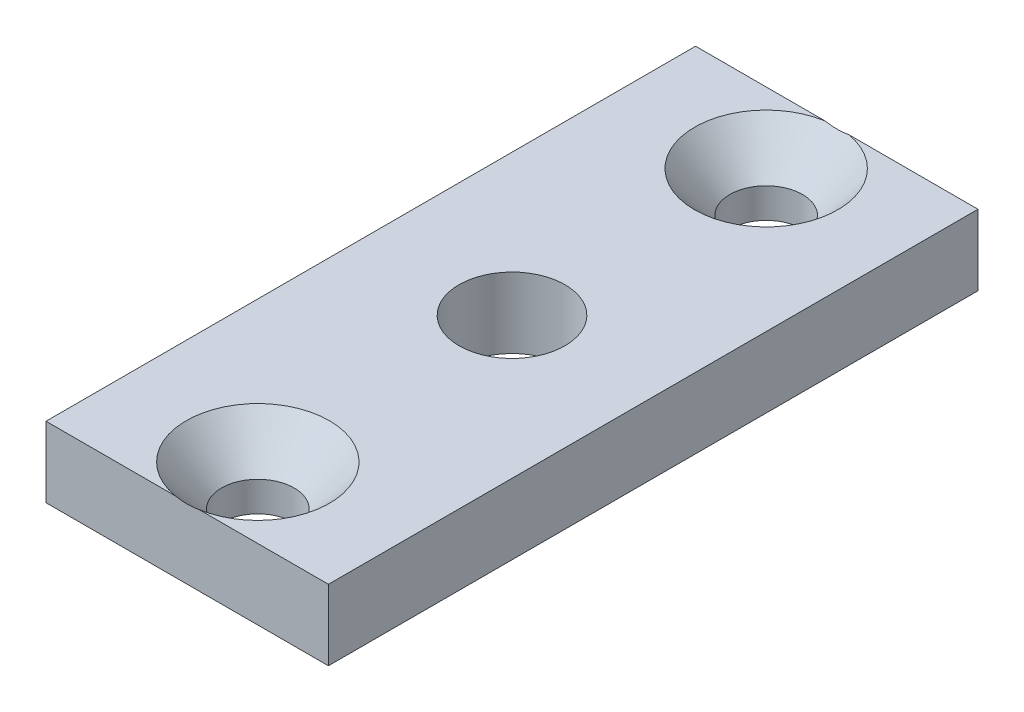
ISO-10303-21;
HEADER;
FILE_DESCRIPTION(('STEP AP214'),'2;1');
FILE_NAME('part.step','',(''),(''),'','','');
FILE_SCHEMA(('AUTOMOTIVE_DESIGN { 1 0 10303 214 1 1 1 1 }'));
ENDSEC;
DATA;
#1=APPLICATION_CONTEXT('core data for automotive mechanical design processes');
#2=APPLICATION_PROTOCOL_DEFINITION('international standard','automotive_design',2000,#1);
#3=PRODUCT_CONTEXT('',#1,'mechanical');
#4=PRODUCT('Part','Part','',(#3));
#5=PRODUCT_RELATED_PRODUCT_CATEGORY('part','',(#4));
#6=PRODUCT_DEFINITION_FORMATION('','',#4);
#7=PRODUCT_DEFINITION_CONTEXT('part definition',#1,'design');
#8=PRODUCT_DEFINITION('design','',#6,#7);
#9=PRODUCT_DEFINITION_SHAPE('','',#8);
#10=(LENGTH_UNIT() NAMED_UNIT(*) SI_UNIT(.MILLI.,.METRE.));
#11=(NAMED_UNIT(*) PLANE_ANGLE_UNIT() SI_UNIT($,.RADIAN.));
#12=(NAMED_UNIT(*) SI_UNIT($,.STERADIAN.) SOLID_ANGLE_UNIT());
#13=UNCERTAINTY_MEASURE_WITH_UNIT(LENGTH_MEASURE(1.E-05),#10,'distance_accuracy_value','');
#14=(GEOMETRIC_REPRESENTATION_CONTEXT(3) GLOBAL_UNCERTAINTY_ASSIGNED_CONTEXT((#13)) GLOBAL_UNIT_ASSIGNED_CONTEXT((#10,
#11,#12)) REPRESENTATION_CONTEXT('',''));
#15=CARTESIAN_POINT('',(0.,0.,0.));
#16=DIRECTION('',(0.,0.,1.));
#17=DIRECTION('',(1.,0.,0.));
#18=AXIS2_PLACEMENT_3D('',#15,#16,#17);
#19=CARTESIAN_POINT('',(-12.7,3.175,58.42));
#20=DIRECTION('',(0.,-1.,0.));
#21=DIRECTION('',(0.,0.,-1.));
#22=AXIS2_PLACEMENT_3D('',#19,#20,#21);
#23=PLANE('',#22);
#24=CARTESIAN_POINT('',(0.,3.175,29.21));
#25=DIRECTION('',(0.,1.,0.));
#26=DIRECTION('',(0.,0.,1.));
#27=AXIS2_PLACEMENT_3D('',#24,#25,#26);
#28=CIRCLE('',#27,4.7625);
#29=CARTESIAN_POINT('',(0.,3.175,33.9725));
#30=VERTEX_POINT('',#29);
#31=EDGE_CURVE('E160',#30,#30,#28,.T.);
#32=ORIENTED_EDGE('',*,*,#31,.F.);
#33=EDGE_LOOP('',(#32));
#34=FACE_BOUND('',#33,.T.);
#35=DIRECTION('',(-1.,0.,0.));
#36=VECTOR('',#35,1.);
#37=CARTESIAN_POINT('',(-12.7,3.175,0.));
#38=LINE('',#37,#36);
#39=CARTESIAN_POINT('',(12.7,3.175,0.));
#40=VERTEX_POINT('',#39);
#41=CARTESIAN_POINT('',(1.06627070202645,3.175,0.));
#42=VERTEX_POINT('',#41);
#43=EDGE_CURVE('E97',#40,#42,#38,.T.);
#44=ORIENTED_EDGE('',*,*,#43,.T.);
#45=CARTESIAN_POINT('',(0.,3.175,6.35));
#46=DIRECTION('',(0.,1.,0.));
#47=DIRECTION('',(0.,0.,1.));
#48=AXIS2_PLACEMENT_3D('',#45,#46,#47);
#49=CIRCLE('',#48,6.4389);
#50=CARTESIAN_POINT('',(-1.06627070202645,3.175,0.));
#51=VERTEX_POINT('',#50);
#52=EDGE_CURVE('E52',#51,#42,#49,.T.);
#53=ORIENTED_EDGE('',*,*,#52,.F.);
#54=CARTESIAN_POINT('',(-12.7,3.175,0.));
#55=VERTEX_POINT('',#54);
#56=EDGE_CURVE('E94',#51,#55,#38,.T.);
#57=ORIENTED_EDGE('',*,*,#56,.T.);
#58=DIRECTION('',(0.,0.,-1.));
#59=VECTOR('',#58,1.);
#60=CARTESIAN_POINT('',(-12.7,3.175,58.42));
#61=LINE('',#60,#59);
#62=CARTESIAN_POINT('',(-12.7,3.175,58.42));
#63=VERTEX_POINT('',#62);
#64=EDGE_CURVE('E128',#63,#55,#61,.T.);
#65=ORIENTED_EDGE('',*,*,#64,.F.);
#66=DIRECTION('',(-1.,0.,0.));
#67=VECTOR('',#66,1.);
#68=CARTESIAN_POINT('',(-12.7,3.175,58.42));
#69=LINE('',#68,#67);
#70=CARTESIAN_POINT('',(-1.06627070202645,3.175,58.42));
#71=VERTEX_POINT('',#70);
#72=EDGE_CURVE('E119',#71,#63,#69,.T.);
#73=ORIENTED_EDGE('',*,*,#72,.F.);
#74=CARTESIAN_POINT('',(0.,3.175,52.07));
#75=DIRECTION('',(0.,1.,0.));
#76=DIRECTION('',(0.,0.,1.));
#77=AXIS2_PLACEMENT_3D('',#74,#75,#76);
#78=CIRCLE('',#77,6.4389);
#79=CARTESIAN_POINT('',(1.06627070202645,3.175,58.42));
#80=VERTEX_POINT('',#79);
#81=EDGE_CURVE('E58',#80,#71,#78,.T.);
#82=ORIENTED_EDGE('',*,*,#81,.F.);
#83=CARTESIAN_POINT('',(12.7,3.175,58.42));
#84=VERTEX_POINT('',#83);
#85=EDGE_CURVE('E174',#84,#80,#69,.T.);
#86=ORIENTED_EDGE('',*,*,#85,.F.);
#87=DIRECTION('',(0.,0.,-1.));
#88=VECTOR('',#87,1.);
#89=CARTESIAN_POINT('',(12.7,3.175,58.42));
#90=LINE('',#89,#88);
#91=EDGE_CURVE('E120',#84,#40,#90,.T.);
#92=ORIENTED_EDGE('',*,*,#91,.T.);
#93=EDGE_LOOP('',(#44,#53,#57,#65,#73,#82,#86,#92));
#94=FACE_BOUND('',#93,.T.);
#95=ADVANCED_FACE('F34',(#34,#94),#23,.F.);
#96=CARTESIAN_POINT('',(-12.7,-3.175,58.42));
#97=DIRECTION('',(1.,0.,0.));
#98=DIRECTION('',(0.,0.,-1.));
#99=AXIS2_PLACEMENT_3D('',#96,#97,#98);
#100=PLANE('',#99);
#101=DIRECTION('',(0.,-1.,0.));
#102=VECTOR('',#101,1.);
#103=CARTESIAN_POINT('',(-12.7,-3.175,0.));
#104=LINE('',#103,#102);
#105=CARTESIAN_POINT('',(-12.7,-3.175,0.));
#106=VERTEX_POINT('',#105);
#107=EDGE_CURVE('E103',#55,#106,#104,.T.);
#108=ORIENTED_EDGE('',*,*,#107,.T.);
#109=DIRECTION('',(0.,0.,-1.));
#110=VECTOR('',#109,1.);
#111=CARTESIAN_POINT('',(-12.7,-3.175,58.42));
#112=LINE('',#111,#110);
#113=CARTESIAN_POINT('',(-12.7,-3.175,58.42));
#114=VERTEX_POINT('',#113);
#115=EDGE_CURVE('E125',#114,#106,#112,.T.);
#116=ORIENTED_EDGE('',*,*,#115,.F.);
#117=DIRECTION('',(0.,-1.,0.));
#118=VECTOR('',#117,1.);
#119=CARTESIAN_POINT('',(-12.7,-3.175,58.42));
#120=LINE('',#119,#118);
#121=EDGE_CURVE('E177',#63,#114,#120,.T.);
#122=ORIENTED_EDGE('',*,*,#121,.F.);
#123=ORIENTED_EDGE('',*,*,#64,.T.);
#124=EDGE_LOOP('',(#108,#116,#122,#123));
#125=FACE_BOUND('',#124,.T.);
#126=ADVANCED_FACE('F151',(#125),#100,.F.);
#127=CARTESIAN_POINT('',(-12.7,-3.175,58.42));
#128=DIRECTION('',(0.,1.,0.));
#129=DIRECTION('',(0.,0.,1.));
#130=AXIS2_PLACEMENT_3D('',#127,#128,#129);
#131=PLANE('',#130);
#132=CARTESIAN_POINT('',(0.,-3.175,29.21));
#133=DIRECTION('',(0.,1.,0.));
#134=DIRECTION('',(0.,0.,1.));
#135=AXIS2_PLACEMENT_3D('',#132,#133,#134);
#136=CIRCLE('',#135,4.7625);
#137=CARTESIAN_POINT('',(0.,-3.175,33.9725));
#138=VERTEX_POINT('',#137);
#139=EDGE_CURVE('E99',#138,#138,#136,.T.);
#140=ORIENTED_EDGE('',*,*,#139,.T.);
#141=EDGE_LOOP('',(#140));
#142=FACE_BOUND('',#141,.T.);
#143=CARTESIAN_POINT('',(0.,-3.175,6.35));
#144=DIRECTION('',(0.,1.,0.));
#145=DIRECTION('',(0.,0.,1.));
#146=AXIS2_PLACEMENT_3D('',#143,#144,#145);
#147=CIRCLE('',#146,3.2639);
#148=CARTESIAN_POINT('',(0.,-3.175,9.6139));
#149=VERTEX_POINT('',#148);
#150=EDGE_CURVE('E168',#149,#149,#147,.T.);
#151=ORIENTED_EDGE('',*,*,#150,.T.);
#152=EDGE_LOOP('',(#151));
#153=FACE_BOUND('',#152,.T.);
#154=CARTESIAN_POINT('',(0.,-3.175,52.07));
#155=DIRECTION('',(0.,1.,0.));
#156=DIRECTION('',(0.,0.,1.));
#157=AXIS2_PLACEMENT_3D('',#154,#155,#156);
#158=CIRCLE('',#157,3.2639);
#159=CARTESIAN_POINT('',(0.,-3.175,55.3339));
#160=VERTEX_POINT('',#159);
#161=EDGE_CURVE('E105',#160,#160,#158,.T.);
#162=ORIENTED_EDGE('',*,*,#161,.T.);
#163=EDGE_LOOP('',(#162));
#164=FACE_BOUND('',#163,.T.);
#165=DIRECTION('',(1.,0.,0.));
#166=VECTOR('',#165,1.);
#167=CARTESIAN_POINT('',(-12.7,-3.175,0.));
#168=LINE('',#167,#166);
#169=CARTESIAN_POINT('',(12.7,-3.175,0.));
#170=VERTEX_POINT('',#169);
#171=EDGE_CURVE('E115',#106,#170,#168,.T.);
#172=ORIENTED_EDGE('',*,*,#171,.T.);
#173=DIRECTION('',(0.,0.,-1.));
#174=VECTOR('',#173,1.);
#175=CARTESIAN_POINT('',(12.7,-3.175,58.42));
#176=LINE('',#175,#174);
#177=CARTESIAN_POINT('',(12.7,-3.175,58.42));
#178=VERTEX_POINT('',#177);
#179=EDGE_CURVE('E122',#178,#170,#176,.T.);
#180=ORIENTED_EDGE('',*,*,#179,.F.);
#181=DIRECTION('',(1.,0.,0.));
#182=VECTOR('',#181,1.);
#183=CARTESIAN_POINT('',(-12.7,-3.175,58.42));
#184=LINE('',#183,#182);
#185=EDGE_CURVE('E178',#114,#178,#184,.T.);
#186=ORIENTED_EDGE('',*,*,#185,.F.);
#187=ORIENTED_EDGE('',*,*,#115,.T.);
#188=EDGE_LOOP('',(#172,#180,#186,#187));
#189=FACE_BOUND('',#188,.T.);
#190=ADVANCED_FACE('F156',(#142,#153,#164,#189),#131,.F.);
#191=CARTESIAN_POINT('',(12.7,-3.175,58.42));
#192=DIRECTION('',(-1.,0.,0.));
#193=DIRECTION('',(0.,-1.,0.));
#194=AXIS2_PLACEMENT_3D('',#191,#192,#193);
#195=PLANE('',#194);
#196=DIRECTION('',(0.,1.,0.));
#197=VECTOR('',#196,1.);
#198=CARTESIAN_POINT('',(12.7,-3.175,0.));
#199=LINE('',#198,#197);
#200=EDGE_CURVE('E117',#170,#40,#199,.T.);
#201=ORIENTED_EDGE('',*,*,#200,.T.);
#202=ORIENTED_EDGE('',*,*,#91,.F.);
#203=DIRECTION('',(0.,1.,0.));
#204=VECTOR('',#203,1.);
#205=CARTESIAN_POINT('',(12.7,-3.175,58.42));
#206=LINE('',#205,#204);
#207=EDGE_CURVE('E112',#178,#84,#206,.T.);
#208=ORIENTED_EDGE('',*,*,#207,.F.);
#209=ORIENTED_EDGE('',*,*,#179,.T.);
#210=EDGE_LOOP('',(#201,#202,#208,#209));
#211=FACE_BOUND('',#210,.T.);
#212=ADVANCED_FACE('F186',(#211),#195,.F.);
#213=CARTESIAN_POINT('',(12.7,3.175,58.42));
#214=DIRECTION('',(0.,0.,1.));
#215=DIRECTION('',(1.,0.,0.));
#216=AXIS2_PLACEMENT_3D('',#213,#214,#215);
#217=PLANE('',#216);
#218=CARTESIAN_POINT('',(-11.1839802070947,10.5627179899053,58.42));
#219=CARTESIAN_POINT('',(-10.9636222205341,10.3423023589109,58.42));
#220=CARTESIAN_POINT('',(-10.7424902098858,10.1226547933378,58.42));
#221=CARTESIAN_POINT('',(-10.2983583368655,9.68522925713907,58.42));
#222=CARTESIAN_POINT('',(-10.075358358355,9.46745140449085,58.42));
#223=CARTESIAN_POINT('',(-9.62670690935167,9.03365135781778,58.42));
#224=CARTESIAN_POINT('',(-9.40105069689866,8.81763406081539,58.42));
#225=CARTESIAN_POINT('',(-8.94717406756645,8.3883166355208,58.42));
#226=CARTESIAN_POINT('',(-8.71895370618502,8.17501644863258,58.42));
#227=CARTESIAN_POINT('',(-8.24852719460883,7.74166991312762,58.42));
#228=CARTESIAN_POINT('',(-8.00617199934212,7.52178500832103,58.42));
#229=CARTESIAN_POINT('',(-7.51739162430576,7.08658937844215,58.42));
#230=CARTESIAN_POINT('',(-7.27096657358585,6.87127850882627,58.42));
#231=CARTESIAN_POINT('',(-6.77334182991921,6.44668360111896,58.42));
#232=CARTESIAN_POINT('',(-6.52214661778448,6.23739433054441,58.42));
#233=CARTESIAN_POINT('',(-6.01361872597103,5.82643802758028,58.42));
#234=CARTESIAN_POINT('',(-5.75628685411584,5.62477000087354,58.42));
#235=CARTESIAN_POINT('',(-5.23589718204714,5.23303129174404,58.42));
#236=CARTESIAN_POINT('',(-4.97289647793567,5.04288526265367,58.42));
#237=CARTESIAN_POINT('',(-4.43730617281549,4.67607029604865,58.42));
#238=CARTESIAN_POINT('',(-4.16471061002849,4.49940996185138,58.42));
#239=CARTESIAN_POINT('',(-3.61130773743908,4.167074645061,58.42));
#240=CARTESIAN_POINT('',(-3.33063725717394,4.01117437488848,58.42));
#241=CARTESIAN_POINT('',(-2.75635724320498,3.72568305691488,58.42));
#242=CARTESIAN_POINT('',(-2.46276955033544,3.59604953097974,58.42));
#243=CARTESIAN_POINT('',(-2.02736471896263,3.43459470636876,58.42));
#244=CARTESIAN_POINT('',(-1.89092089607614,3.38820046606447,58.42));
#245=CARTESIAN_POINT('',(-1.6151226664679,3.30376395464495,58.42));
#246=CARTESIAN_POINT('',(-1.47576255745147,3.26574013220903,58.42));
#247=CARTESIAN_POINT('',(-1.17313799419652,3.1941076863132,58.42));
#248=CARTESIAN_POINT('',(-1.00949378391138,3.16207776245118,58.42));
#249=CARTESIAN_POINT('',(-0.680011357685657,3.11209706760959,58.42));
#250=CARTESIAN_POINT('',(-0.514172726214597,3.0941490030841,58.42));
#251=CARTESIAN_POINT('',(-0.181718040798198,3.07323141316284,58.42));
#252=CARTESIAN_POINT('',(-0.0151030105687272,3.07024585482903,58.42));
#253=CARTESIAN_POINT('',(0.317699813088047,3.07936503357243,58.42));
#254=CARTESIAN_POINT('',(0.483887629014791,3.09146895893465,58.42));
#255=CARTESIAN_POINT('',(0.808424937009629,3.12943685726929,58.42));
#256=CARTESIAN_POINT('',(0.9668369794813,3.15477528134776,58.42));
#257=CARTESIAN_POINT('',(1.28119175230661,3.21780344316817,58.42));
#258=CARTESIAN_POINT('',(1.43713395062507,3.25549580516475,58.42));
#259=CARTESIAN_POINT('',(1.74615668884845,3.34191807358951,58.42));
#260=CARTESIAN_POINT('',(1.89923245905505,3.39066486527855,58.42));
#261=CARTESIAN_POINT('',(2.20198161975296,3.49768941658646,58.42));
#262=CARTESIAN_POINT('',(2.35165500698046,3.55596718534768,58.42));
#263=CARTESIAN_POINT('',(2.69482561322219,3.7005623657779,58.42));
#264=CARTESIAN_POINT('',(2.88705057689575,3.78989027316899,58.42));
#265=CARTESIAN_POINT('',(3.26585176324822,3.97988068716216,58.42));
#266=CARTESIAN_POINT('',(3.45242538512757,4.08054831478733,58.42));
#267=CARTESIAN_POINT('',(3.82071392850178,4.29108854442966,58.42));
#268=CARTESIAN_POINT('',(4.00241954014717,4.40097732476464,58.42));
#269=CARTESIAN_POINT('',(4.36119750987233,4.62797817668104,58.42));
#270=CARTESIAN_POINT('',(4.53827051410041,4.74508923317892,58.42));
#271=CARTESIAN_POINT('',(4.89106675207438,4.98697933756327,58.42));
#272=CARTESIAN_POINT('',(5.06672821932307,5.11184808786566,58.42));
#273=CARTESIAN_POINT('',(5.41446694475221,5.36647307038855,58.42));
#274=CARTESIAN_POINT('',(5.58654409843563,5.49622944479391,58.42));
#275=CARTESIAN_POINT('',(5.92740850217916,5.75960571792507,58.42));
#276=CARTESIAN_POINT('',(6.09619912603227,5.89322126227792,58.42));
#277=CARTESIAN_POINT('',(6.43108919729067,6.16376179937584,58.42));
#278=CARTESIAN_POINT('',(6.59718875342802,6.30068665784891,58.42));
#279=CARTESIAN_POINT('',(6.95496923633563,6.60071459035477,58.42));
#280=CARTESIAN_POINT('',(7.1462227957147,6.76432669655312,58.42));
#281=CARTESIAN_POINT('',(7.52601783628198,7.09467276147172,58.42));
#282=CARTESIAN_POINT('',(7.7145592310122,7.26140681932482,58.42));
#283=CARTESIAN_POINT('',(8.27676182982906,7.76551936519347,58.42));
#284=CARTESIAN_POINT('',(8.64695343678738,8.10676750135069,58.42));
#285=CARTESIAN_POINT('',(9.38061047692481,8.79674298237456,58.42));
#286=CARTESIAN_POINT('',(9.74407239963551,9.14547403664597,58.42));
#287=CARTESIAN_POINT('',(10.4657160999089,9.84836821295903,58.42));
#288=CARTESIAN_POINT('',(10.8238977215826,10.2025314947476,58.42));
#289=CARTESIAN_POINT('',(11.5370036841532,10.91584314052,58.42));
#290=CARTESIAN_POINT('',(11.8919179449536,11.2750015594678,58.42));
#291=CARTESIAN_POINT('',(12.5984612835543,11.9965417118762,58.42));
#292=CARTESIAN_POINT('',(12.9500903118869,12.3589234937132,58.42));
#293=CARTESIAN_POINT('',(13.6505842126423,13.0861226168203,58.42));
#294=CARTESIAN_POINT('',(13.9994499337987,13.4509391413822,58.42));
#295=CARTESIAN_POINT('',(14.6950127711691,14.1826334988279,58.42));
#296=CARTESIAN_POINT('',(15.0417098823834,14.5495113364603,58.42));
#297=CARTESIAN_POINT('',(15.9944786891378,15.5626553988035,58.42));
#298=CARTESIAN_POINT('',(16.5986925926927,16.2106683744166,58.42));
#299=CARTESIAN_POINT('',(17.8031366551251,17.5104907563402,58.42));
#300=CARTESIAN_POINT('',(18.403366439563,18.1623005089702,58.42));
#301=CARTESIAN_POINT('',(19.5981000920707,19.4658268927023,58.42));
#302=CARTESIAN_POINT('',(20.1926175515212,20.1175310732738,58.42));
#303=CARTESIAN_POINT('',(21.0825899876413,21.0966603167492,58.42));
#304=CARTESIAN_POINT('',(21.3789307845558,21.4232810996915,58.42));
#305=CARTESIAN_POINT('',(21.971084408434,22.0770002193601,58.42));
#306=CARTESIAN_POINT('',(22.2668972360402,22.4040985555045,58.42));
#307=CARTESIAN_POINT('',(22.5624776425266,22.7314068272458,58.42));
#308=B_SPLINE_CURVE_WITH_KNOTS('',3,(#218,#219,#220,#221,#222,#223,#224,#225,#226,#227,#228,
#229,#230,#231,#232,#233,#234,#235,#236,#237,#238,#239,#240,#241,#242,#243,#244,#245,#246,#247,
#248,#249,#250,#251,#252,#253,#254,#255,#256,#257,#258,#259,#260,#261,#262,#263,#264,#265,#266,
#267,#268,#269,#270,#271,#272,#273,#274,#275,#276,#277,#278,#279,#280,#281,#282,#283,#284,#285,
#286,#287,#288,#289,#290,#291,#292,#293,#294,#295,#296,#297,#298,#299,#300,#301,#302,#303,#304,
#305,#306,#307),.UNSPECIFIED.,.F.,.F.,(4,2,2,2,2,2,2,2,2,2,2,2,2,2,2,2,2,2,2,2,2,2,2,2,2,2,2,2,
2,2,2,2,2,2,2,2,2,2,2,2,2,2,2,2,4),(0.,0.935026199252868,1.87011097057019,2.80724621555807,
3.74436121636609,4.72603268130574,5.70767307827024,6.68843300361297,7.66906452774245,
8.64237441659487,9.6163001359485,10.5786025366734,11.5393360744329,11.9714594570966,
12.404525924623,12.9042036531938,13.4039773935017,13.9032154911094,14.4024267341498,
14.8831720369939,15.3640195272244,15.8456065026338,16.3271939399961,16.9626046178791,
17.5983034067221,18.2351418187614,18.8718909269064,19.5183506435253,20.1648291807156,
20.8106047764989,21.4563542144456,22.2113756501237,22.9664211011616,24.4767008008694,
25.9877473056591,27.4988383317079,29.0136163780279,30.5284171966585,32.0427331533867,
33.5570526000619,36.2150247170107,38.873243198374,41.5196524358695,42.8427132531815,
44.1657724597773),.UNSPECIFIED.);
#309=EDGE_CURVE('E46',#71,#80,#308,.T.);
#310=ORIENTED_EDGE('',*,*,#309,.F.);
#311=ORIENTED_EDGE('',*,*,#72,.T.);
#312=ORIENTED_EDGE('',*,*,#121,.T.);
#313=ORIENTED_EDGE('',*,*,#185,.T.);
#314=ORIENTED_EDGE('',*,*,#207,.T.);
#315=ORIENTED_EDGE('',*,*,#85,.T.);
#316=EDGE_LOOP('',(#310,#311,#312,#313,#314,#315));
#317=FACE_BOUND('',#316,.T.);
#318=ADVANCED_FACE('F134',(#317),#217,.T.);
#319=CARTESIAN_POINT('',(12.7,3.175,0.));
#320=DIRECTION('',(0.,0.,1.));
#321=DIRECTION('',(1.,0.,0.));
#322=AXIS2_PLACEMENT_3D('',#319,#320,#321);
#323=PLANE('',#322);
#324=ORIENTED_EDGE('',*,*,#56,.F.);
#325=CARTESIAN_POINT('',(-11.1839802070947,10.5627179899053,0.));
#326=CARTESIAN_POINT('',(-10.9636222205341,10.3423023589109,0.));
#327=CARTESIAN_POINT('',(-10.7424902098858,10.1226547933378,0.));
#328=CARTESIAN_POINT('',(-10.2983583368655,9.68522925713907,0.));
#329=CARTESIAN_POINT('',(-10.075358358355,9.46745140449086,0.));
#330=CARTESIAN_POINT('',(-9.62670690935167,9.03365135781778,0.));
#331=CARTESIAN_POINT('',(-9.40105069689866,8.81763406081539,0.));
#332=CARTESIAN_POINT('',(-8.94717406756645,8.3883166355208,0.));
#333=CARTESIAN_POINT('',(-8.71895370618502,8.17501644863258,0.));
#334=CARTESIAN_POINT('',(-8.24852719460882,7.74166991312762,0.));
#335=CARTESIAN_POINT('',(-8.00617199934212,7.52178500832103,0.));
#336=CARTESIAN_POINT('',(-7.51739162430575,7.08658937844215,0.));
#337=CARTESIAN_POINT('',(-7.27096657358585,6.87127850882627,0.));
#338=CARTESIAN_POINT('',(-6.77334182991921,6.44668360111896,0.));
#339=CARTESIAN_POINT('',(-6.52214661778448,6.23739433054441,0.));
#340=CARTESIAN_POINT('',(-6.01361872597103,5.82643802758028,0.));
#341=CARTESIAN_POINT('',(-5.75628685411584,5.62477000087354,0.));
#342=CARTESIAN_POINT('',(-5.23589718204714,5.23303129174404,0.));
#343=CARTESIAN_POINT('',(-4.97289647793567,5.04288526265367,0.));
#344=CARTESIAN_POINT('',(-4.43730617281549,4.67607029604865,0.));
#345=CARTESIAN_POINT('',(-4.16471061002849,4.49940996185138,0.));
#346=CARTESIAN_POINT('',(-3.61130773743908,4.167074645061,0.));
#347=CARTESIAN_POINT('',(-3.33063725717394,4.01117437488848,0.));
#348=CARTESIAN_POINT('',(-2.75635724320498,3.72568305691488,0.));
#349=CARTESIAN_POINT('',(-2.46276955033544,3.59604953097974,0.));
#350=CARTESIAN_POINT('',(-2.02736471896263,3.43459470636876,0.));
#351=CARTESIAN_POINT('',(-1.89092089607614,3.38820046606447,0.));
#352=CARTESIAN_POINT('',(-1.6151226664679,3.30376395464496,0.));
#353=CARTESIAN_POINT('',(-1.47576255745147,3.26574013220903,0.));
#354=CARTESIAN_POINT('',(-1.17313799419652,3.1941076863132,0.));
#355=CARTESIAN_POINT('',(-1.00949378391138,3.16207776245118,0.));
#356=CARTESIAN_POINT('',(-0.680011357685657,3.11209706760959,0.));
#357=CARTESIAN_POINT('',(-0.514172726214597,3.0941490030841,0.));
#358=CARTESIAN_POINT('',(-0.181718040798198,3.07323141316284,0.));
#359=CARTESIAN_POINT('',(-0.0151030105687271,3.07024585482903,0.));
#360=CARTESIAN_POINT('',(0.317699813088047,3.07936503357243,0.));
#361=CARTESIAN_POINT('',(0.483887629014791,3.09146895893465,0.));
#362=CARTESIAN_POINT('',(0.808424937009629,3.12943685726929,0.));
#363=CARTESIAN_POINT('',(0.9668369794813,3.15477528134775,0.));
#364=CARTESIAN_POINT('',(1.28119175230661,3.21780344316817,0.));
#365=CARTESIAN_POINT('',(1.43713395062507,3.25549580516475,0.));
#366=CARTESIAN_POINT('',(1.74615668884845,3.34191807358951,0.));
#367=CARTESIAN_POINT('',(1.89923245905505,3.39066486527855,0.));
#368=CARTESIAN_POINT('',(2.20198161975296,3.49768941658646,0.));
#369=CARTESIAN_POINT('',(2.35165500698046,3.55596718534768,0.));
#370=CARTESIAN_POINT('',(2.69482561322219,3.7005623657779,0.));
#371=CARTESIAN_POINT('',(2.88705057689575,3.78989027316899,0.));
#372=CARTESIAN_POINT('',(3.26585176324822,3.97988068716216,0.));
#373=CARTESIAN_POINT('',(3.45242538512757,4.08054831478733,0.));
#374=CARTESIAN_POINT('',(3.82071392850178,4.29108854442966,0.));
#375=CARTESIAN_POINT('',(4.00241954014717,4.40097732476464,0.));
#376=CARTESIAN_POINT('',(4.36119750987233,4.62797817668104,0.));
#377=CARTESIAN_POINT('',(4.53827051410041,4.74508923317892,0.));
#378=CARTESIAN_POINT('',(4.89106675207438,4.98697933756327,0.));
#379=CARTESIAN_POINT('',(5.06672821932307,5.11184808786566,0.));
#380=CARTESIAN_POINT('',(5.41446694475221,5.36647307038855,0.));
#381=CARTESIAN_POINT('',(5.58654409843563,5.49622944479391,0.));
#382=CARTESIAN_POINT('',(5.92740850217916,5.75960571792507,0.));
#383=CARTESIAN_POINT('',(6.09619912603227,5.89322126227792,0.));
#384=CARTESIAN_POINT('',(6.43108919729067,6.16376179937584,0.));
#385=CARTESIAN_POINT('',(6.59718875342802,6.30068665784891,0.));
#386=CARTESIAN_POINT('',(6.95496923633563,6.60071459035477,0.));
#387=CARTESIAN_POINT('',(7.1462227957147,6.76432669655312,0.));
#388=CARTESIAN_POINT('',(7.52601783628198,7.09467276147172,0.));
#389=CARTESIAN_POINT('',(7.7145592310122,7.26140681932482,0.));
#390=CARTESIAN_POINT('',(8.27676182982906,7.76551936519347,0.));
#391=CARTESIAN_POINT('',(8.64695343678738,8.10676750135069,0.));
#392=CARTESIAN_POINT('',(9.38061047692481,8.79674298237456,0.));
#393=CARTESIAN_POINT('',(9.74407239963551,9.14547403664597,0.));
#394=CARTESIAN_POINT('',(10.4657160999089,9.84836821295903,0.));
#395=CARTESIAN_POINT('',(10.8238977215826,10.2025314947476,0.));
#396=CARTESIAN_POINT('',(11.5370036841532,10.91584314052,0.));
#397=CARTESIAN_POINT('',(11.8919179449536,11.2750015594678,0.));
#398=CARTESIAN_POINT('',(12.5984612835543,11.9965417118762,0.));
#399=CARTESIAN_POINT('',(12.9500903118869,12.3589234937132,0.));
#400=CARTESIAN_POINT('',(13.6505842126423,13.0861226168203,0.));
#401=CARTESIAN_POINT('',(13.9994499337987,13.4509391413822,0.));
#402=CARTESIAN_POINT('',(14.6950127711691,14.1826334988279,0.));
#403=CARTESIAN_POINT('',(15.0417098823834,14.5495113364603,0.));
#404=CARTESIAN_POINT('',(15.9944786891378,15.5626553988035,0.));
#405=CARTESIAN_POINT('',(16.5986925926927,16.2106683744166,0.));
#406=CARTESIAN_POINT('',(17.8031366551251,17.5104907563402,0.));
#407=CARTESIAN_POINT('',(18.403366439563,18.1623005089702,0.));
#408=CARTESIAN_POINT('',(19.5981000920707,19.4658268927023,0.));
#409=CARTESIAN_POINT('',(20.1926175515212,20.1175310732738,0.));
#410=CARTESIAN_POINT('',(21.0825899876413,21.0966603167492,0.));
#411=CARTESIAN_POINT('',(21.3789307845558,21.4232810996915,0.));
#412=CARTESIAN_POINT('',(21.971084408434,22.0770002193601,0.));
#413=CARTESIAN_POINT('',(22.2668972360402,22.4040985555045,0.));
#414=CARTESIAN_POINT('',(22.5624776425266,22.7314068272458,0.));
#415=B_SPLINE_CURVE_WITH_KNOTS('',3,(#325,#326,#327,#328,#329,#330,#331,#332,#333,#334,#335,
#336,#337,#338,#339,#340,#341,#342,#343,#344,#345,#346,#347,#348,#349,#350,#351,#352,#353,#354,
#355,#356,#357,#358,#359,#360,#361,#362,#363,#364,#365,#366,#367,#368,#369,#370,#371,#372,#373,
#374,#375,#376,#377,#378,#379,#380,#381,#382,#383,#384,#385,#386,#387,#388,#389,#390,#391,#392,
#393,#394,#395,#396,#397,#398,#399,#400,#401,#402,#403,#404,#405,#406,#407,#408,#409,#410,#411,
#412,#413,#414),.UNSPECIFIED.,.F.,.F.,(4,2,2,2,2,2,2,2,2,2,2,2,2,2,2,2,2,2,2,2,2,2,2,2,2,2,2,2,
2,2,2,2,2,2,2,2,2,2,2,2,2,2,2,2,4),(0.,0.935026199252868,1.87011097057019,2.80724621555807,
3.74436121636609,4.72603268130574,5.70767307827024,6.68843300361297,7.66906452774245,
8.64237441659487,9.6163001359485,10.5786025366734,11.5393360744329,11.9714594570966,
12.404525924623,12.9042036531938,13.4039773935017,13.9032154911094,14.4024267341498,
14.8831720369939,15.3640195272244,15.8456065026338,16.3271939399961,16.9626046178791,
17.5983034067221,18.2351418187614,18.8718909269064,19.5183506435253,20.1648291807156,
20.8106047764989,21.4563542144456,22.2113756501237,22.9664211011616,24.4767008008694,
25.9877473056591,27.4988383317079,29.0136163780279,30.5284171966585,32.0427331533867,
33.5570526000619,36.2150247170107,38.873243198374,41.5196524358695,42.8427132531815,
44.1657724597773),.UNSPECIFIED.);
#416=EDGE_CURVE('E11',#51,#42,#415,.T.);
#417=ORIENTED_EDGE('',*,*,#416,.T.);
#418=ORIENTED_EDGE('',*,*,#43,.F.);
#419=ORIENTED_EDGE('',*,*,#200,.F.);
#420=ORIENTED_EDGE('',*,*,#171,.F.);
#421=ORIENTED_EDGE('',*,*,#107,.F.);
#422=EDGE_LOOP('',(#324,#417,#418,#419,#420,#421));
#423=FACE_BOUND('',#422,.T.);
#424=ADVANCED_FACE('F101',(#423),#323,.F.);
#425=CARTESIAN_POINT('',(0.,3.175,52.07));
#426=DIRECTION('',(0.,1.,0.));
#427=DIRECTION('',(0.,0.,1.));
#428=AXIS2_PLACEMENT_3D('',#425,#426,#427);
#429=CYLINDRICAL_SURFACE('',#428,3.2639);
#430=ORIENTED_EDGE('',*,*,#161,.F.);
#431=EDGE_LOOP('',(#430));
#432=FACE_BOUND('',#431,.T.);
#433=CARTESIAN_POINT('',(0.,-0.477419692926707,52.07));
#434=DIRECTION('',(0.,1.,0.));
#435=DIRECTION('',(0.,0.,1.));
#436=AXIS2_PLACEMENT_3D('',#433,#434,#435);
#437=CIRCLE('',#436,3.2639);
#438=CARTESIAN_POINT('',(0.,-0.477419692926707,55.3339));
#439=VERTEX_POINT('',#438);
#440=EDGE_CURVE('E108',#439,#439,#437,.T.);
#441=ORIENTED_EDGE('',*,*,#440,.T.);
#442=EDGE_LOOP('',(#441));
#443=FACE_BOUND('',#442,.T.);
#444=ADVANCED_FACE('F141',(#432,#443),#429,.F.);
#445=CARTESIAN_POINT('',(0.,3.175,52.07));
#446=DIRECTION('',(0.,1.,0.));
#447=DIRECTION('',(0.,0.,1.));
#448=AXIS2_PLACEMENT_3D('',#445,#446,#447);
#449=CONICAL_SURFACE('',#448,6.4389,0.715584993317675);
#450=ORIENTED_EDGE('',*,*,#309,.T.);
#451=ORIENTED_EDGE('',*,*,#81,.T.);
#452=EDGE_LOOP('',(#450,#451));
#453=FACE_BOUND('',#452,.T.);
#454=ORIENTED_EDGE('',*,*,#440,.F.);
#455=EDGE_LOOP('',(#454));
#456=FACE_BOUND('',#455,.T.);
#457=ADVANCED_FACE('F137',(#453,#456),#449,.F.);
#458=CARTESIAN_POINT('',(0.,3.175,6.35));
#459=DIRECTION('',(0.,1.,0.));
#460=DIRECTION('',(0.,0.,1.));
#461=AXIS2_PLACEMENT_3D('',#458,#459,#460);
#462=CONICAL_SURFACE('',#461,6.4389,0.715584993317675);
#463=CARTESIAN_POINT('',(0.,-0.477419692926707,6.35));
#464=DIRECTION('',(0.,1.,0.));
#465=DIRECTION('',(0.,0.,1.));
#466=AXIS2_PLACEMENT_3D('',#463,#464,#465);
#467=CIRCLE('',#466,3.2639);
#468=CARTESIAN_POINT('',(0.,-0.477419692926707,9.6139));
#469=VERTEX_POINT('',#468);
#470=EDGE_CURVE('E98',#469,#469,#467,.T.);
#471=ORIENTED_EDGE('',*,*,#470,.F.);
#472=EDGE_LOOP('',(#471));
#473=FACE_BOUND('',#472,.T.);
#474=ORIENTED_EDGE('',*,*,#52,.T.);
#475=ORIENTED_EDGE('',*,*,#416,.F.);
#476=EDGE_LOOP('',(#474,#475));
#477=FACE_BOUND('',#476,.T.);
#478=ADVANCED_FACE('F87',(#473,#477),#462,.F.);
#479=CARTESIAN_POINT('',(0.,3.175,6.35));
#480=DIRECTION('',(0.,1.,0.));
#481=DIRECTION('',(0.,0.,1.));
#482=AXIS2_PLACEMENT_3D('',#479,#480,#481);
#483=CYLINDRICAL_SURFACE('',#482,3.2639);
#484=ORIENTED_EDGE('',*,*,#150,.F.);
#485=EDGE_LOOP('',(#484));
#486=FACE_BOUND('',#485,.T.);
#487=ORIENTED_EDGE('',*,*,#470,.T.);
#488=EDGE_LOOP('',(#487));
#489=FACE_BOUND('',#488,.T.);
#490=ADVANCED_FACE('F142',(#486,#489),#483,.F.);
#491=CARTESIAN_POINT('',(0.,3.175,29.21));
#492=DIRECTION('',(0.,1.,0.));
#493=DIRECTION('',(0.,0.,1.));
#494=AXIS2_PLACEMENT_3D('',#491,#492,#493);
#495=CYLINDRICAL_SURFACE('',#494,4.7625);
#496=ORIENTED_EDGE('',*,*,#139,.F.);
#497=EDGE_LOOP('',(#496));
#498=FACE_BOUND('',#497,.T.);
#499=ORIENTED_EDGE('',*,*,#31,.T.);
#500=EDGE_LOOP('',(#499));
#501=FACE_BOUND('',#500,.T.);
#502=ADVANCED_FACE('F207',(#498,#501),#495,.F.);
#503=CLOSED_SHELL('',(#95,#126,#190,#212,#318,#424,#444,#457,#478,#490,#502));
#504=MANIFOLD_SOLID_BREP('B2',#503);
#505=ADVANCED_BREP_SHAPE_REPRESENTATION('',(#18,#504),#14);
#506=SHAPE_DEFINITION_REPRESENTATION(#9,#505);
ENDSEC;
END-ISO-10303-21;
